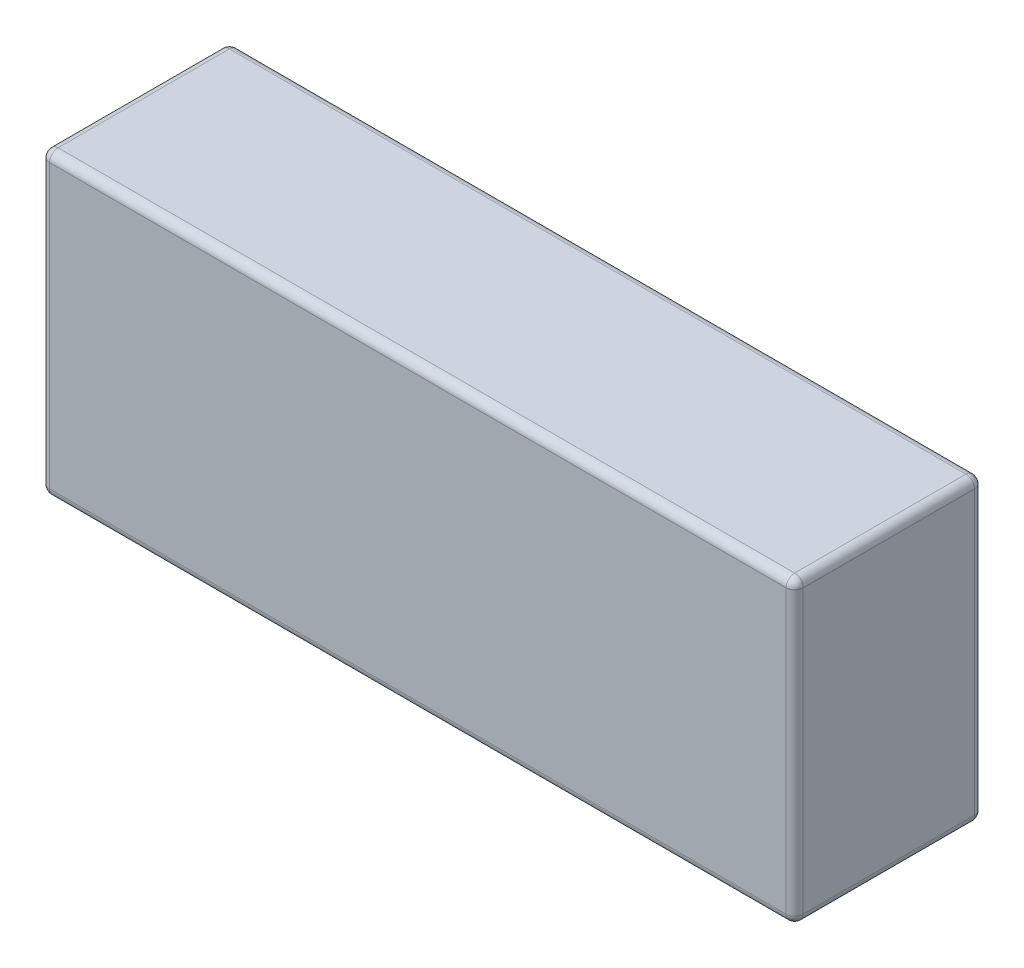
ISO-10303-21;
HEADER;
FILE_DESCRIPTION(('STEP AP214'),'2;1');
FILE_NAME('part.step','',(''),(''),'','','');
FILE_SCHEMA(('AUTOMOTIVE_DESIGN { 1 0 10303 214 1 1 1 1 }'));
ENDSEC;
DATA;
#1=APPLICATION_CONTEXT('core data for automotive mechanical design processes');
#2=APPLICATION_PROTOCOL_DEFINITION('international standard','automotive_design',2000,#1);
#3=PRODUCT_CONTEXT('',#1,'mechanical');
#4=PRODUCT('Part','Part','',(#3));
#5=PRODUCT_RELATED_PRODUCT_CATEGORY('part','',(#4));
#6=PRODUCT_DEFINITION_FORMATION('','',#4);
#7=PRODUCT_DEFINITION_CONTEXT('part definition',#1,'design');
#8=PRODUCT_DEFINITION('design','',#6,#7);
#9=PRODUCT_DEFINITION_SHAPE('','',#8);
#10=(LENGTH_UNIT() NAMED_UNIT(*) SI_UNIT(.MILLI.,.METRE.));
#11=(NAMED_UNIT(*) PLANE_ANGLE_UNIT() SI_UNIT($,.RADIAN.));
#12=(NAMED_UNIT(*) SI_UNIT($,.STERADIAN.) SOLID_ANGLE_UNIT());
#13=UNCERTAINTY_MEASURE_WITH_UNIT(LENGTH_MEASURE(1.E-05),#10,'distance_accuracy_value','');
#14=(GEOMETRIC_REPRESENTATION_CONTEXT(3) GLOBAL_UNCERTAINTY_ASSIGNED_CONTEXT((#13)) GLOBAL_UNIT_ASSIGNED_CONTEXT((#10,
#11,#12)) REPRESENTATION_CONTEXT('',''));
#15=CARTESIAN_POINT('',(0.,0.,0.));
#16=DIRECTION('',(0.,0.,1.));
#17=DIRECTION('',(1.,0.,0.));
#18=AXIS2_PLACEMENT_3D('',#15,#16,#17);
#19=CARTESIAN_POINT('',(44.,35.,11.));
#20=DIRECTION('',(-1.,0.,0.));
#21=DIRECTION('',(0.,0.,1.));
#22=AXIS2_PLACEMENT_3D('',#19,#20,#21);
#23=PLANE('',#22);
#24=DIRECTION('',(0.,-1.,0.));
#25=VECTOR('',#24,1.);
#26=CARTESIAN_POINT('',(44.,35.,-10.));
#27=LINE('',#26,#25);
#28=CARTESIAN_POINT('',(44.,1.,-10.));
#29=VERTEX_POINT('',#28);
#30=CARTESIAN_POINT('',(44.,34.,-10.));
#31=VERTEX_POINT('',#30);
#32=EDGE_CURVE('E134',#29,#31,#27,.F.);
#33=ORIENTED_EDGE('',*,*,#32,.T.);
#34=DIRECTION('',(0.,0.,-1.));
#35=VECTOR('',#34,1.);
#36=CARTESIAN_POINT('',(44.,34.,11.));
#37=LINE('',#36,#35);
#38=CARTESIAN_POINT('',(44.,34.,10.));
#39=VERTEX_POINT('',#38);
#40=EDGE_CURVE('E171',#31,#39,#37,.F.);
#41=ORIENTED_EDGE('',*,*,#40,.T.);
#42=DIRECTION('',(0.,-1.,0.));
#43=VECTOR('',#42,1.);
#44=CARTESIAN_POINT('',(44.,35.,10.));
#45=LINE('',#44,#43);
#46=CARTESIAN_POINT('',(44.,1.,10.));
#47=VERTEX_POINT('',#46);
#48=EDGE_CURVE('E168',#39,#47,#45,.T.);
#49=ORIENTED_EDGE('',*,*,#48,.T.);
#50=DIRECTION('',(0.,0.,-1.));
#51=VECTOR('',#50,1.);
#52=CARTESIAN_POINT('',(44.,1.,-11.));
#53=LINE('',#52,#51);
#54=EDGE_CURVE('E163',#47,#29,#53,.T.);
#55=ORIENTED_EDGE('',*,*,#54,.T.);
#56=EDGE_LOOP('',(#33,#41,#49,#55));
#57=FACE_BOUND('',#56,.T.);
#58=ADVANCED_FACE('F39',(#57),#23,.F.);
#59=CARTESIAN_POINT('',(-44.,35.,-11.));
#60=DIRECTION('',(0.,0.,1.));
#61=DIRECTION('',(1.,0.,0.));
#62=AXIS2_PLACEMENT_3D('',#59,#60,#61);
#63=PLANE('',#62);
#64=DIRECTION('',(0.,-1.,0.));
#65=VECTOR('',#64,1.);
#66=CARTESIAN_POINT('',(-43.,35.,-11.));
#67=LINE('',#66,#65);
#68=CARTESIAN_POINT('',(-43.,1.,-11.));
#69=VERTEX_POINT('',#68);
#70=CARTESIAN_POINT('',(-43.,34.,-11.));
#71=VERTEX_POINT('',#70);
#72=EDGE_CURVE('E156',#69,#71,#67,.F.);
#73=ORIENTED_EDGE('',*,*,#72,.T.);
#74=DIRECTION('',(-1.,0.,0.));
#75=VECTOR('',#74,1.);
#76=CARTESIAN_POINT('',(-44.,34.,-11.));
#77=LINE('',#76,#75);
#78=CARTESIAN_POINT('',(43.,34.,-11.));
#79=VERTEX_POINT('',#78);
#80=EDGE_CURVE('E160',#71,#79,#77,.F.);
#81=ORIENTED_EDGE('',*,*,#80,.T.);
#82=DIRECTION('',(0.,-1.,0.));
#83=VECTOR('',#82,1.);
#84=CARTESIAN_POINT('',(43.,35.,-11.));
#85=LINE('',#84,#83);
#86=CARTESIAN_POINT('',(43.,1.,-11.));
#87=VERTEX_POINT('',#86);
#88=EDGE_CURVE('E132',#79,#87,#85,.T.);
#89=ORIENTED_EDGE('',*,*,#88,.T.);
#90=DIRECTION('',(-1.,0.,0.));
#91=VECTOR('',#90,1.);
#92=CARTESIAN_POINT('',(-44.,1.,-11.));
#93=LINE('',#92,#91);
#94=EDGE_CURVE('E150',#87,#69,#93,.T.);
#95=ORIENTED_EDGE('',*,*,#94,.T.);
#96=EDGE_LOOP('',(#73,#81,#89,#95));
#97=FACE_BOUND('',#96,.T.);
#98=ADVANCED_FACE('F158',(#97),#63,.F.);
#99=CARTESIAN_POINT('',(-44.,35.,11.));
#100=DIRECTION('',(1.,0.,0.));
#101=DIRECTION('',(0.,0.,-1.));
#102=AXIS2_PLACEMENT_3D('',#99,#100,#101);
#103=PLANE('',#102);
#104=DIRECTION('',(0.,-1.,0.));
#105=VECTOR('',#104,1.);
#106=CARTESIAN_POINT('',(-44.,35.,10.));
#107=LINE('',#106,#105);
#108=CARTESIAN_POINT('',(-44.,1.,10.));
#109=VERTEX_POINT('',#108);
#110=CARTESIAN_POINT('',(-44.,34.,10.));
#111=VERTEX_POINT('',#110);
#112=EDGE_CURVE('E175',#109,#111,#107,.F.);
#113=ORIENTED_EDGE('',*,*,#112,.T.);
#114=DIRECTION('',(0.,0.,1.));
#115=VECTOR('',#114,1.);
#116=CARTESIAN_POINT('',(-44.,34.,11.));
#117=LINE('',#116,#115);
#118=CARTESIAN_POINT('',(-44.,34.,-10.));
#119=VERTEX_POINT('',#118);
#120=EDGE_CURVE('E180',#111,#119,#117,.F.);
#121=ORIENTED_EDGE('',*,*,#120,.T.);
#122=DIRECTION('',(0.,-1.,0.));
#123=VECTOR('',#122,1.);
#124=CARTESIAN_POINT('',(-44.,35.,-10.));
#125=LINE('',#124,#123);
#126=CARTESIAN_POINT('',(-44.,1.,-10.));
#127=VERTEX_POINT('',#126);
#128=EDGE_CURVE('E177',#119,#127,#125,.T.);
#129=ORIENTED_EDGE('',*,*,#128,.T.);
#130=DIRECTION('',(0.,0.,1.));
#131=VECTOR('',#130,1.);
#132=CARTESIAN_POINT('',(-44.,1.,11.));
#133=LINE('',#132,#131);
#134=EDGE_CURVE('E173',#127,#109,#133,.T.);
#135=ORIENTED_EDGE('',*,*,#134,.T.);
#136=EDGE_LOOP('',(#113,#121,#129,#135));
#137=FACE_BOUND('',#136,.T.);
#138=ADVANCED_FACE('F285',(#137),#103,.F.);
#139=CARTESIAN_POINT('',(-44.,35.,11.));
#140=DIRECTION('',(0.,0.,-1.));
#141=DIRECTION('',(-1.,0.,0.));
#142=AXIS2_PLACEMENT_3D('',#139,#140,#141);
#143=PLANE('',#142);
#144=DIRECTION('',(0.,-1.,0.));
#145=VECTOR('',#144,1.);
#146=CARTESIAN_POINT('',(43.,35.,11.));
#147=LINE('',#146,#145);
#148=CARTESIAN_POINT('',(43.,1.,11.));
#149=VERTEX_POINT('',#148);
#150=CARTESIAN_POINT('',(43.,34.,11.));
#151=VERTEX_POINT('',#150);
#152=EDGE_CURVE('E184',#149,#151,#147,.F.);
#153=ORIENTED_EDGE('',*,*,#152,.T.);
#154=DIRECTION('',(1.,0.,0.));
#155=VECTOR('',#154,1.);
#156=CARTESIAN_POINT('',(-44.,34.,11.));
#157=LINE('',#156,#155);
#158=CARTESIAN_POINT('',(-43.,34.,11.));
#159=VERTEX_POINT('',#158);
#160=EDGE_CURVE('E189',#151,#159,#157,.F.);
#161=ORIENTED_EDGE('',*,*,#160,.T.);
#162=DIRECTION('',(0.,-1.,0.));
#163=VECTOR('',#162,1.);
#164=CARTESIAN_POINT('',(-43.,35.,11.));
#165=LINE('',#164,#163);
#166=CARTESIAN_POINT('',(-43.,1.,11.));
#167=VERTEX_POINT('',#166);
#168=EDGE_CURVE('E186',#159,#167,#165,.T.);
#169=ORIENTED_EDGE('',*,*,#168,.T.);
#170=DIRECTION('',(1.,0.,0.));
#171=VECTOR('',#170,1.);
#172=CARTESIAN_POINT('',(44.,1.,11.));
#173=LINE('',#172,#171);
#174=EDGE_CURVE('E182',#167,#149,#173,.T.);
#175=ORIENTED_EDGE('',*,*,#174,.T.);
#176=EDGE_LOOP('',(#153,#161,#169,#175));
#177=FACE_BOUND('',#176,.T.);
#178=ADVANCED_FACE('F295',(#177),#143,.F.);
#179=CARTESIAN_POINT('',(0.,35.,0.));
#180=DIRECTION('',(0.,-1.,0.));
#181=DIRECTION('',(0.,0.,-1.));
#182=AXIS2_PLACEMENT_3D('',#179,#180,#181);
#183=PLANE('',#182);
#184=DIRECTION('',(0.,0.,1.));
#185=VECTOR('',#184,1.);
#186=CARTESIAN_POINT('',(-43.,35.,0.));
#187=LINE('',#186,#185);
#188=CARTESIAN_POINT('',(-43.,35.,-10.));
#189=VERTEX_POINT('',#188);
#190=CARTESIAN_POINT('',(-43.,35.,10.));
#191=VERTEX_POINT('',#190);
#192=EDGE_CURVE('E195',#189,#191,#187,.T.);
#193=ORIENTED_EDGE('',*,*,#192,.T.);
#194=DIRECTION('',(1.,0.,0.));
#195=VECTOR('',#194,1.);
#196=CARTESIAN_POINT('',(0.,35.,10.));
#197=LINE('',#196,#195);
#198=CARTESIAN_POINT('',(43.,35.,10.));
#199=VERTEX_POINT('',#198);
#200=EDGE_CURVE('E197',#191,#199,#197,.T.);
#201=ORIENTED_EDGE('',*,*,#200,.T.);
#202=DIRECTION('',(0.,0.,-1.));
#203=VECTOR('',#202,1.);
#204=CARTESIAN_POINT('',(43.,35.,0.));
#205=LINE('',#204,#203);
#206=CARTESIAN_POINT('',(43.,35.,-10.));
#207=VERTEX_POINT('',#206);
#208=EDGE_CURVE('E191',#199,#207,#205,.T.);
#209=ORIENTED_EDGE('',*,*,#208,.T.);
#210=DIRECTION('',(-1.,0.,0.));
#211=VECTOR('',#210,1.);
#212=CARTESIAN_POINT('',(0.,35.,-10.));
#213=LINE('',#212,#211);
#214=EDGE_CURVE('E193',#207,#189,#213,.T.);
#215=ORIENTED_EDGE('',*,*,#214,.T.);
#216=EDGE_LOOP('',(#193,#201,#209,#215));
#217=FACE_BOUND('',#216,.T.);
#218=ADVANCED_FACE('F277',(#217),#183,.F.);
#219=CARTESIAN_POINT('',(0.,0.,0.));
#220=DIRECTION('',(0.,-1.,0.));
#221=DIRECTION('',(0.,0.,-1.));
#222=AXIS2_PLACEMENT_3D('',#219,#220,#221);
#223=PLANE('',#222);
#224=DIRECTION('',(0.,0.,-1.));
#225=VECTOR('',#224,1.);
#226=CARTESIAN_POINT('',(43.,0.,11.));
#227=LINE('',#226,#225);
#228=CARTESIAN_POINT('',(43.,0.,-10.));
#229=VERTEX_POINT('',#228);
#230=CARTESIAN_POINT('',(43.,0.,10.));
#231=VERTEX_POINT('',#230);
#232=EDGE_CURVE('E200',#229,#231,#227,.F.);
#233=ORIENTED_EDGE('',*,*,#232,.T.);
#234=DIRECTION('',(1.,0.,0.));
#235=VECTOR('',#234,1.);
#236=CARTESIAN_POINT('',(-44.,0.,10.));
#237=LINE('',#236,#235);
#238=CARTESIAN_POINT('',(-43.,0.,10.));
#239=VERTEX_POINT('',#238);
#240=EDGE_CURVE('E11',#231,#239,#237,.F.);
#241=ORIENTED_EDGE('',*,*,#240,.T.);
#242=DIRECTION('',(0.,0.,1.));
#243=VECTOR('',#242,1.);
#244=CARTESIAN_POINT('',(-43.,0.,-11.));
#245=LINE('',#244,#243);
#246=CARTESIAN_POINT('',(-43.,0.,-10.));
#247=VERTEX_POINT('',#246);
#248=EDGE_CURVE('E48',#239,#247,#245,.F.);
#249=ORIENTED_EDGE('',*,*,#248,.T.);
#250=DIRECTION('',(-1.,0.,0.));
#251=VECTOR('',#250,1.);
#252=CARTESIAN_POINT('',(44.,0.,-10.));
#253=LINE('',#252,#251);
#254=EDGE_CURVE('E202',#247,#229,#253,.F.);
#255=ORIENTED_EDGE('',*,*,#254,.T.);
#256=EDGE_LOOP('',(#233,#241,#249,#255));
#257=FACE_BOUND('',#256,.T.);
#258=ADVANCED_FACE('F484',(#257),#223,.T.);
#259=CARTESIAN_POINT('',(-43.,35.,10.));
#260=DIRECTION('',(0.,-1.,0.));
#261=DIRECTION('',(0.,0.,-1.));
#262=AXIS2_PLACEMENT_3D('',#259,#260,#261);
#263=CYLINDRICAL_SURFACE('',#262,1.);
#264=CARTESIAN_POINT('',(-43.,34.,10.));
#265=DIRECTION('',(0.,1.,0.));
#266=DIRECTION('',(0.,0.,1.));
#267=AXIS2_PLACEMENT_3D('',#264,#265,#266);
#268=CIRCLE('',#267,1.);
#269=EDGE_CURVE('E43',#111,#159,#268,.T.);
#270=ORIENTED_EDGE('',*,*,#269,.F.);
#271=ORIENTED_EDGE('',*,*,#112,.F.);
#272=CARTESIAN_POINT('',(-43.,1.,10.));
#273=DIRECTION('',(0.,-1.,0.));
#274=DIRECTION('',(0.,0.,-1.));
#275=AXIS2_PLACEMENT_3D('',#272,#273,#274);
#276=CIRCLE('',#275,1.);
#277=EDGE_CURVE('E255',#167,#109,#276,.T.);
#278=ORIENTED_EDGE('',*,*,#277,.F.);
#279=ORIENTED_EDGE('',*,*,#168,.F.);
#280=EDGE_LOOP('',(#270,#271,#278,#279));
#281=FACE_BOUND('',#280,.T.);
#282=ADVANCED_FACE('F41',(#281),#263,.T.);
#283=CARTESIAN_POINT('',(-43.,34.,10.));
#284=DIRECTION('',(0.,0.,1.));
#285=DIRECTION('',(1.,0.,0.));
#286=AXIS2_PLACEMENT_3D('',#283,#284,#285);
#287=SPHERICAL_SURFACE('',#286,1.);
#288=CARTESIAN_POINT('',(-43.,34.,10.));
#289=DIRECTION('',(0.,0.,1.));
#290=DIRECTION('',(1.,0.,0.));
#291=AXIS2_PLACEMENT_3D('',#288,#289,#290);
#292=CIRCLE('',#291,1.);
#293=EDGE_CURVE('E250',#111,#191,#292,.F.);
#294=ORIENTED_EDGE('',*,*,#293,.F.);
#295=ORIENTED_EDGE('',*,*,#269,.T.);
#296=CARTESIAN_POINT('',(-43.,34.,10.));
#297=DIRECTION('',(-1.,0.,0.));
#298=DIRECTION('',(0.,0.,1.));
#299=AXIS2_PLACEMENT_3D('',#296,#297,#298);
#300=CIRCLE('',#299,1.);
#301=EDGE_CURVE('E253',#191,#159,#300,.F.);
#302=ORIENTED_EDGE('',*,*,#301,.F.);
#303=EDGE_LOOP('',(#294,#295,#302));
#304=FACE_BOUND('',#303,.T.);
#305=ADVANCED_FACE('F265',(#304),#287,.T.);
#306=CARTESIAN_POINT('',(-43.,1.,10.));
#307=DIRECTION('',(0.,0.,1.));
#308=DIRECTION('',(1.,0.,0.));
#309=AXIS2_PLACEMENT_3D('',#306,#307,#308);
#310=SPHERICAL_SURFACE('',#309,1.);
#311=CARTESIAN_POINT('',(-43.,1.,10.));
#312=DIRECTION('',(-1.,0.,0.));
#313=DIRECTION('',(0.,0.,1.));
#314=AXIS2_PLACEMENT_3D('',#311,#312,#313);
#315=CIRCLE('',#314,1.);
#316=EDGE_CURVE('E245',#167,#239,#315,.F.);
#317=ORIENTED_EDGE('',*,*,#316,.F.);
#318=ORIENTED_EDGE('',*,*,#277,.T.);
#319=CARTESIAN_POINT('',(-43.,1.,10.));
#320=DIRECTION('',(0.,0.,1.));
#321=DIRECTION('',(1.,0.,0.));
#322=AXIS2_PLACEMENT_3D('',#319,#320,#321);
#323=CIRCLE('',#322,1.);
#324=EDGE_CURVE('E248',#239,#109,#323,.F.);
#325=ORIENTED_EDGE('',*,*,#324,.F.);
#326=EDGE_LOOP('',(#317,#318,#325));
#327=FACE_BOUND('',#326,.T.);
#328=ADVANCED_FACE('F463',(#327),#310,.T.);
#329=CARTESIAN_POINT('',(0.,34.,10.));
#330=DIRECTION('',(1.,0.,0.));
#331=DIRECTION('',(0.,0.,-1.));
#332=AXIS2_PLACEMENT_3D('',#329,#330,#331);
#333=CYLINDRICAL_SURFACE('',#332,1.);
#334=ORIENTED_EDGE('',*,*,#301,.T.);
#335=ORIENTED_EDGE('',*,*,#160,.F.);
#336=CARTESIAN_POINT('',(43.,34.,10.));
#337=DIRECTION('',(1.,0.,0.));
#338=DIRECTION('',(0.,0.,-1.));
#339=AXIS2_PLACEMENT_3D('',#336,#337,#338);
#340=CIRCLE('',#339,1.);
#341=EDGE_CURVE('E239',#199,#151,#340,.T.);
#342=ORIENTED_EDGE('',*,*,#341,.F.);
#343=ORIENTED_EDGE('',*,*,#200,.F.);
#344=EDGE_LOOP('',(#334,#335,#342,#343));
#345=FACE_BOUND('',#344,.T.);
#346=ADVANCED_FACE('F273',(#345),#333,.T.);
#347=CARTESIAN_POINT('',(-43.,34.,0.));
#348=DIRECTION('',(0.,0.,1.));
#349=DIRECTION('',(1.,0.,0.));
#350=AXIS2_PLACEMENT_3D('',#347,#348,#349);
#351=CYLINDRICAL_SURFACE('',#350,1.);
#352=ORIENTED_EDGE('',*,*,#293,.T.);
#353=ORIENTED_EDGE('',*,*,#192,.F.);
#354=CARTESIAN_POINT('',(-43.,34.,-10.));
#355=DIRECTION('',(0.,0.,-1.));
#356=DIRECTION('',(0.,1.,0.));
#357=AXIS2_PLACEMENT_3D('',#354,#355,#356);
#358=CIRCLE('',#357,1.);
#359=EDGE_CURVE('E236',#119,#189,#358,.T.);
#360=ORIENTED_EDGE('',*,*,#359,.F.);
#361=ORIENTED_EDGE('',*,*,#120,.F.);
#362=EDGE_LOOP('',(#352,#353,#360,#361));
#363=FACE_BOUND('',#362,.T.);
#364=ADVANCED_FACE('F282',(#363),#351,.T.);
#365=CARTESIAN_POINT('',(-43.,35.,-10.));
#366=DIRECTION('',(0.,-1.,0.));
#367=DIRECTION('',(0.,0.,-1.));
#368=AXIS2_PLACEMENT_3D('',#365,#366,#367);
#369=CYLINDRICAL_SURFACE('',#368,1.);
#370=CARTESIAN_POINT('',(-43.,1.,-10.));
#371=DIRECTION('',(0.,-1.,0.));
#372=DIRECTION('',(0.,0.,-1.));
#373=AXIS2_PLACEMENT_3D('',#370,#371,#372);
#374=CIRCLE('',#373,1.);
#375=EDGE_CURVE('E230',#127,#69,#374,.T.);
#376=ORIENTED_EDGE('',*,*,#375,.F.);
#377=ORIENTED_EDGE('',*,*,#128,.F.);
#378=CARTESIAN_POINT('',(-43.,34.,-10.));
#379=DIRECTION('',(0.,1.,0.));
#380=DIRECTION('',(0.,0.,1.));
#381=AXIS2_PLACEMENT_3D('',#378,#379,#380);
#382=CIRCLE('',#381,1.);
#383=EDGE_CURVE('E233',#71,#119,#382,.T.);
#384=ORIENTED_EDGE('',*,*,#383,.F.);
#385=ORIENTED_EDGE('',*,*,#72,.F.);
#386=EDGE_LOOP('',(#376,#377,#384,#385));
#387=FACE_BOUND('',#386,.T.);
#388=ADVANCED_FACE('F289',(#387),#369,.T.);
#389=CARTESIAN_POINT('',(-43.,1.,11.));
#390=DIRECTION('',(0.,0.,-1.));
#391=DIRECTION('',(-1.,0.,0.));
#392=AXIS2_PLACEMENT_3D('',#389,#390,#391);
#393=CYLINDRICAL_SURFACE('',#392,1.);
#394=ORIENTED_EDGE('',*,*,#324,.T.);
#395=ORIENTED_EDGE('',*,*,#134,.F.);
#396=CARTESIAN_POINT('',(-43.,1.,-10.));
#397=DIRECTION('',(0.,0.,-1.));
#398=DIRECTION('',(-1.,0.,0.));
#399=AXIS2_PLACEMENT_3D('',#396,#397,#398);
#400=CIRCLE('',#399,1.);
#401=EDGE_CURVE('E228',#247,#127,#400,.T.);
#402=ORIENTED_EDGE('',*,*,#401,.F.);
#403=ORIENTED_EDGE('',*,*,#248,.F.);
#404=EDGE_LOOP('',(#394,#395,#402,#403));
#405=FACE_BOUND('',#404,.T.);
#406=ADVANCED_FACE('F293',(#405),#393,.T.);
#407=CARTESIAN_POINT('',(-44.,1.,10.));
#408=DIRECTION('',(-1.,0.,0.));
#409=DIRECTION('',(0.,0.,1.));
#410=AXIS2_PLACEMENT_3D('',#407,#408,#409);
#411=CYLINDRICAL_SURFACE('',#410,1.);
#412=ORIENTED_EDGE('',*,*,#316,.T.);
#413=ORIENTED_EDGE('',*,*,#240,.F.);
#414=CARTESIAN_POINT('',(43.,1.,10.));
#415=DIRECTION('',(1.,0.,0.));
#416=DIRECTION('',(0.,0.,-1.));
#417=AXIS2_PLACEMENT_3D('',#414,#415,#416);
#418=CIRCLE('',#417,1.);
#419=EDGE_CURVE('E225',#149,#231,#418,.T.);
#420=ORIENTED_EDGE('',*,*,#419,.F.);
#421=ORIENTED_EDGE('',*,*,#174,.F.);
#422=EDGE_LOOP('',(#412,#413,#420,#421));
#423=FACE_BOUND('',#422,.T.);
#424=ADVANCED_FACE('F305',(#423),#411,.T.);
#425=CARTESIAN_POINT('',(43.,35.,10.));
#426=DIRECTION('',(0.,-1.,0.));
#427=DIRECTION('',(0.,0.,-1.));
#428=AXIS2_PLACEMENT_3D('',#425,#426,#427);
#429=CYLINDRICAL_SURFACE('',#428,1.);
#430=CARTESIAN_POINT('',(43.,34.,10.));
#431=DIRECTION('',(0.,1.,0.));
#432=DIRECTION('',(0.,0.,1.));
#433=AXIS2_PLACEMENT_3D('',#430,#431,#432);
#434=CIRCLE('',#433,1.);
#435=EDGE_CURVE('E242',#151,#39,#434,.T.);
#436=ORIENTED_EDGE('',*,*,#435,.F.);
#437=ORIENTED_EDGE('',*,*,#152,.F.);
#438=CARTESIAN_POINT('',(43.,1.,10.));
#439=DIRECTION('',(0.,-1.,0.));
#440=DIRECTION('',(0.,0.,-1.));
#441=AXIS2_PLACEMENT_3D('',#438,#439,#440);
#442=CIRCLE('',#441,1.);
#443=EDGE_CURVE('E222',#47,#149,#442,.T.);
#444=ORIENTED_EDGE('',*,*,#443,.F.);
#445=ORIENTED_EDGE('',*,*,#48,.F.);
#446=EDGE_LOOP('',(#436,#437,#444,#445));
#447=FACE_BOUND('',#446,.T.);
#448=ADVANCED_FACE('F300',(#447),#429,.T.);
#449=CARTESIAN_POINT('',(43.,34.,10.));
#450=DIRECTION('',(0.,0.,1.));
#451=DIRECTION('',(1.,0.,0.));
#452=AXIS2_PLACEMENT_3D('',#449,#450,#451);
#453=SPHERICAL_SURFACE('',#452,1.);
#454=ORIENTED_EDGE('',*,*,#341,.T.);
#455=ORIENTED_EDGE('',*,*,#435,.T.);
#456=CARTESIAN_POINT('',(43.,34.,10.));
#457=DIRECTION('',(0.,0.,1.));
#458=DIRECTION('',(1.,0.,0.));
#459=AXIS2_PLACEMENT_3D('',#456,#457,#458);
#460=CIRCLE('',#459,1.);
#461=EDGE_CURVE('E219',#199,#39,#460,.F.);
#462=ORIENTED_EDGE('',*,*,#461,.F.);
#463=EDGE_LOOP('',(#454,#455,#462));
#464=FACE_BOUND('',#463,.T.);
#465=ADVANCED_FACE('F316',(#464),#453,.T.);
#466=CARTESIAN_POINT('',(-43.,34.,-10.));
#467=DIRECTION('',(0.,0.,1.));
#468=DIRECTION('',(1.,0.,0.));
#469=AXIS2_PLACEMENT_3D('',#466,#467,#468);
#470=SPHERICAL_SURFACE('',#469,1.);
#471=ORIENTED_EDGE('',*,*,#383,.T.);
#472=ORIENTED_EDGE('',*,*,#359,.T.);
#473=CARTESIAN_POINT('',(-43.,34.,-10.));
#474=DIRECTION('',(-1.,0.,0.));
#475=DIRECTION('',(0.,0.,1.));
#476=AXIS2_PLACEMENT_3D('',#473,#474,#475);
#477=CIRCLE('',#476,1.);
#478=EDGE_CURVE('E216',#71,#189,#477,.F.);
#479=ORIENTED_EDGE('',*,*,#478,.F.);
#480=EDGE_LOOP('',(#471,#472,#479));
#481=FACE_BOUND('',#480,.T.);
#482=ADVANCED_FACE('F326',(#481),#470,.T.);
#483=CARTESIAN_POINT('',(-43.,1.,-10.));
#484=DIRECTION('',(0.,0.,1.));
#485=DIRECTION('',(1.,0.,0.));
#486=AXIS2_PLACEMENT_3D('',#483,#484,#485);
#487=SPHERICAL_SURFACE('',#486,1.);
#488=ORIENTED_EDGE('',*,*,#401,.T.);
#489=ORIENTED_EDGE('',*,*,#375,.T.);
#490=CARTESIAN_POINT('',(-43.,1.,-10.));
#491=DIRECTION('',(-1.,0.,0.));
#492=DIRECTION('',(0.,0.,1.));
#493=AXIS2_PLACEMENT_3D('',#490,#491,#492);
#494=CIRCLE('',#493,1.);
#495=EDGE_CURVE('E153',#247,#69,#494,.F.);
#496=ORIENTED_EDGE('',*,*,#495,.F.);
#497=EDGE_LOOP('',(#488,#489,#496));
#498=FACE_BOUND('',#497,.T.);
#499=ADVANCED_FACE('F328',(#498),#487,.T.);
#500=CARTESIAN_POINT('',(43.,1.,10.));
#501=DIRECTION('',(0.,0.,1.));
#502=DIRECTION('',(1.,0.,0.));
#503=AXIS2_PLACEMENT_3D('',#500,#501,#502);
#504=SPHERICAL_SURFACE('',#503,1.);
#505=ORIENTED_EDGE('',*,*,#443,.T.);
#506=ORIENTED_EDGE('',*,*,#419,.T.);
#507=CARTESIAN_POINT('',(43.,1.,10.));
#508=DIRECTION('',(0.,0.,1.));
#509=DIRECTION('',(1.,0.,0.));
#510=AXIS2_PLACEMENT_3D('',#507,#508,#509);
#511=CIRCLE('',#510,1.);
#512=EDGE_CURVE('E212',#47,#231,#511,.F.);
#513=ORIENTED_EDGE('',*,*,#512,.F.);
#514=EDGE_LOOP('',(#505,#506,#513));
#515=FACE_BOUND('',#514,.T.);
#516=ADVANCED_FACE('F307',(#515),#504,.T.);
#517=CARTESIAN_POINT('',(43.,34.,0.));
#518=DIRECTION('',(0.,0.,-1.));
#519=DIRECTION('',(-1.,0.,0.));
#520=AXIS2_PLACEMENT_3D('',#517,#518,#519);
#521=CYLINDRICAL_SURFACE('',#520,1.);
#522=ORIENTED_EDGE('',*,*,#461,.T.);
#523=ORIENTED_EDGE('',*,*,#40,.F.);
#524=CARTESIAN_POINT('',(43.,34.,-10.));
#525=DIRECTION('',(0.,0.,-1.));
#526=DIRECTION('',(-1.,0.,0.));
#527=AXIS2_PLACEMENT_3D('',#524,#525,#526);
#528=CIRCLE('',#527,1.);
#529=EDGE_CURVE('E209',#207,#31,#528,.T.);
#530=ORIENTED_EDGE('',*,*,#529,.F.);
#531=ORIENTED_EDGE('',*,*,#208,.F.);
#532=EDGE_LOOP('',(#522,#523,#530,#531));
#533=FACE_BOUND('',#532,.T.);
#534=ADVANCED_FACE('F318',(#533),#521,.T.);
#535=CARTESIAN_POINT('',(0.,34.,-10.));
#536=DIRECTION('',(-1.,0.,0.));
#537=DIRECTION('',(0.,0.,1.));
#538=AXIS2_PLACEMENT_3D('',#535,#536,#537);
#539=CYLINDRICAL_SURFACE('',#538,1.);
#540=ORIENTED_EDGE('',*,*,#478,.T.);
#541=ORIENTED_EDGE('',*,*,#214,.F.);
#542=CARTESIAN_POINT('',(43.,34.,-10.));
#543=DIRECTION('',(1.,0.,0.));
#544=DIRECTION('',(0.,0.,-1.));
#545=AXIS2_PLACEMENT_3D('',#542,#543,#544);
#546=CIRCLE('',#545,1.);
#547=EDGE_CURVE('E147',#79,#207,#546,.T.);
#548=ORIENTED_EDGE('',*,*,#547,.F.);
#549=ORIENTED_EDGE('',*,*,#80,.F.);
#550=EDGE_LOOP('',(#540,#541,#548,#549));
#551=FACE_BOUND('',#550,.T.);
#552=ADVANCED_FACE('F324',(#551),#539,.T.);
#553=CARTESIAN_POINT('',(-44.,1.,-10.));
#554=DIRECTION('',(1.,0.,0.));
#555=DIRECTION('',(0.,0.,-1.));
#556=AXIS2_PLACEMENT_3D('',#553,#554,#555);
#557=CYLINDRICAL_SURFACE('',#556,1.);
#558=ORIENTED_EDGE('',*,*,#495,.T.);
#559=ORIENTED_EDGE('',*,*,#94,.F.);
#560=CARTESIAN_POINT('',(43.,1.,-10.));
#561=DIRECTION('',(1.,0.,0.));
#562=DIRECTION('',(0.,0.,-1.));
#563=AXIS2_PLACEMENT_3D('',#560,#561,#562);
#564=CIRCLE('',#563,1.);
#565=EDGE_CURVE('E140',#229,#87,#564,.T.);
#566=ORIENTED_EDGE('',*,*,#565,.F.);
#567=ORIENTED_EDGE('',*,*,#254,.F.);
#568=EDGE_LOOP('',(#558,#559,#566,#567));
#569=FACE_BOUND('',#568,.T.);
#570=ADVANCED_FACE('F151',(#569),#557,.T.);
#571=CARTESIAN_POINT('',(43.,1.,11.));
#572=DIRECTION('',(0.,0.,1.));
#573=DIRECTION('',(1.,0.,0.));
#574=AXIS2_PLACEMENT_3D('',#571,#572,#573);
#575=CYLINDRICAL_SURFACE('',#574,1.);
#576=ORIENTED_EDGE('',*,*,#512,.T.);
#577=ORIENTED_EDGE('',*,*,#232,.F.);
#578=CARTESIAN_POINT('',(43.,1.,-10.));
#579=DIRECTION('',(0.,0.,-1.));
#580=DIRECTION('',(-1.,0.,0.));
#581=AXIS2_PLACEMENT_3D('',#578,#579,#580);
#582=CIRCLE('',#581,1.);
#583=EDGE_CURVE('E144',#29,#229,#582,.T.);
#584=ORIENTED_EDGE('',*,*,#583,.F.);
#585=ORIENTED_EDGE('',*,*,#54,.F.);
#586=EDGE_LOOP('',(#576,#577,#584,#585));
#587=FACE_BOUND('',#586,.T.);
#588=ADVANCED_FACE('F311',(#587),#575,.T.);
#589=CARTESIAN_POINT('',(43.,34.,-10.));
#590=DIRECTION('',(0.,0.,1.));
#591=DIRECTION('',(1.,0.,0.));
#592=AXIS2_PLACEMENT_3D('',#589,#590,#591);
#593=SPHERICAL_SURFACE('',#592,1.);
#594=ORIENTED_EDGE('',*,*,#547,.T.);
#595=ORIENTED_EDGE('',*,*,#529,.T.);
#596=CARTESIAN_POINT('',(43.,34.,-10.));
#597=DIRECTION('',(0.,1.,0.));
#598=DIRECTION('',(0.,0.,1.));
#599=AXIS2_PLACEMENT_3D('',#596,#597,#598);
#600=CIRCLE('',#599,1.);
#601=EDGE_CURVE('E137',#79,#31,#600,.F.);
#602=ORIENTED_EDGE('',*,*,#601,.F.);
#603=EDGE_LOOP('',(#594,#595,#602));
#604=FACE_BOUND('',#603,.T.);
#605=ADVANCED_FACE('F322',(#604),#593,.T.);
#606=CARTESIAN_POINT('',(43.,1.,-10.));
#607=DIRECTION('',(0.,0.,1.));
#608=DIRECTION('',(1.,0.,0.));
#609=AXIS2_PLACEMENT_3D('',#606,#607,#608);
#610=SPHERICAL_SURFACE('',#609,1.);
#611=ORIENTED_EDGE('',*,*,#583,.T.);
#612=ORIENTED_EDGE('',*,*,#565,.T.);
#613=CARTESIAN_POINT('',(43.,1.,-10.));
#614=DIRECTION('',(0.,-1.,0.));
#615=DIRECTION('',(0.,0.,-1.));
#616=AXIS2_PLACEMENT_3D('',#613,#614,#615);
#617=CIRCLE('',#616,1.);
#618=EDGE_CURVE('E128',#29,#87,#617,.F.);
#619=ORIENTED_EDGE('',*,*,#618,.F.);
#620=EDGE_LOOP('',(#611,#612,#619));
#621=FACE_BOUND('',#620,.T.);
#622=ADVANCED_FACE('F142',(#621),#610,.T.);
#623=CARTESIAN_POINT('',(43.,35.,-10.));
#624=DIRECTION('',(0.,-1.,0.));
#625=DIRECTION('',(0.,0.,-1.));
#626=AXIS2_PLACEMENT_3D('',#623,#624,#625);
#627=CYLINDRICAL_SURFACE('',#626,1.);
#628=ORIENTED_EDGE('',*,*,#601,.T.);
#629=ORIENTED_EDGE('',*,*,#32,.F.);
#630=ORIENTED_EDGE('',*,*,#618,.T.);
#631=ORIENTED_EDGE('',*,*,#88,.F.);
#632=EDGE_LOOP('',(#628,#629,#630,#631));
#633=FACE_BOUND('',#632,.T.);
#634=ADVANCED_FACE('F130',(#633),#627,.T.);
#635=CLOSED_SHELL('',(#58,#98,#138,#178,#218,#258,#282,#305,#328,#346,#364,#388,#406,#424,#448,
#465,#482,#499,#516,#534,#552,#570,#588,#605,#622,#634));
#636=MANIFOLD_SOLID_BREP('B2',#635);
#637=ADVANCED_BREP_SHAPE_REPRESENTATION('',(#18,#636),#14);
#638=SHAPE_DEFINITION_REPRESENTATION(#9,#637);
ENDSEC;
END-ISO-10303-21;
